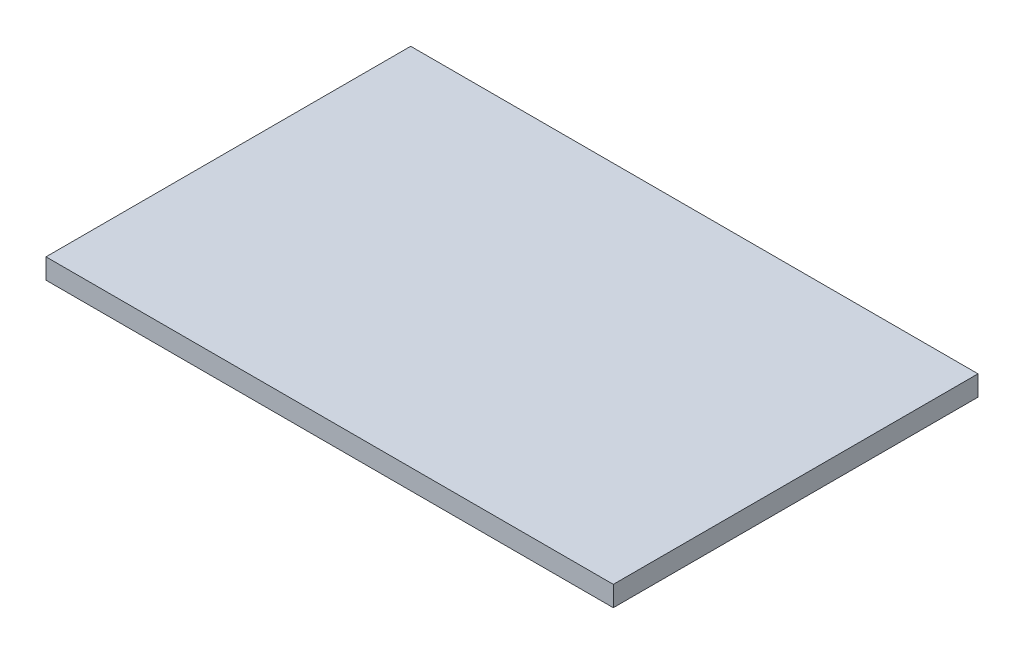
ISO-10303-21;
HEADER;
FILE_DESCRIPTION(('STEP AP214'),'2;1');
FILE_NAME('part.step','',(''),(''),'','','');
FILE_SCHEMA(('AUTOMOTIVE_DESIGN { 1 0 10303 214 1 1 1 1 }'));
ENDSEC;
DATA;
#1=APPLICATION_CONTEXT('core data for automotive mechanical design processes');
#2=APPLICATION_PROTOCOL_DEFINITION('international standard','automotive_design',2000,#1);
#3=PRODUCT_CONTEXT('',#1,'mechanical');
#4=PRODUCT('Part','Part','',(#3));
#5=PRODUCT_RELATED_PRODUCT_CATEGORY('part','',(#4));
#6=PRODUCT_DEFINITION_FORMATION('','',#4);
#7=PRODUCT_DEFINITION_CONTEXT('part definition',#1,'design');
#8=PRODUCT_DEFINITION('design','',#6,#7);
#9=PRODUCT_DEFINITION_SHAPE('','',#8);
#10=(LENGTH_UNIT() NAMED_UNIT(*) SI_UNIT(.MILLI.,.METRE.));
#11=(NAMED_UNIT(*) PLANE_ANGLE_UNIT() SI_UNIT($,.RADIAN.));
#12=(NAMED_UNIT(*) SI_UNIT($,.STERADIAN.) SOLID_ANGLE_UNIT());
#13=UNCERTAINTY_MEASURE_WITH_UNIT(LENGTH_MEASURE(1.E-05),#10,'distance_accuracy_value','');
#14=(GEOMETRIC_REPRESENTATION_CONTEXT(3) GLOBAL_UNCERTAINTY_ASSIGNED_CONTEXT((#13)) GLOBAL_UNIT_ASSIGNED_CONTEXT((#10,
#11,#12)) REPRESENTATION_CONTEXT('',''));
#15=CARTESIAN_POINT('',(0.,0.,0.));
#16=DIRECTION('',(0.,0.,1.));
#17=DIRECTION('',(1.,0.,0.));
#18=AXIS2_PLACEMENT_3D('',#15,#16,#17);
#19=CARTESIAN_POINT('',(0.,0.25,0.));
#20=DIRECTION('',(1.,0.,0.));
#21=DIRECTION('',(0.,0.,-1.));
#22=AXIS2_PLACEMENT_3D('',#19,#20,#21);
#23=PLANE('',#22);
#24=DIRECTION('',(0.,0.,1.));
#25=VECTOR('',#24,1.);
#26=CARTESIAN_POINT('',(0.,0.,0.));
#27=LINE('',#26,#25);
#28=CARTESIAN_POINT('',(0.,0.,-4.5));
#29=VERTEX_POINT('',#28);
#30=CARTESIAN_POINT('',(0.,0.,0.));
#31=VERTEX_POINT('',#30);
#32=EDGE_CURVE('E96',#29,#31,#27,.T.);
#33=ORIENTED_EDGE('',*,*,#32,.T.);
#34=DIRECTION('',(0.,-1.,0.));
#35=VECTOR('',#34,1.);
#36=CARTESIAN_POINT('',(0.,0.25,0.));
#37=LINE('',#36,#35);
#38=CARTESIAN_POINT('',(0.,0.25,0.));
#39=VERTEX_POINT('',#38);
#40=EDGE_CURVE('E11',#39,#31,#37,.T.);
#41=ORIENTED_EDGE('',*,*,#40,.F.);
#42=DIRECTION('',(0.,0.,1.));
#43=VECTOR('',#42,1.);
#44=CARTESIAN_POINT('',(0.,0.25,0.));
#45=LINE('',#44,#43);
#46=CARTESIAN_POINT('',(0.,0.25,-4.5));
#47=VERTEX_POINT('',#46);
#48=EDGE_CURVE('E84',#47,#39,#45,.T.);
#49=ORIENTED_EDGE('',*,*,#48,.F.);
#50=DIRECTION('',(0.,-1.,0.));
#51=VECTOR('',#50,1.);
#52=CARTESIAN_POINT('',(0.,0.25,-4.5));
#53=LINE('',#52,#51);
#54=EDGE_CURVE('E92',#47,#29,#53,.T.);
#55=ORIENTED_EDGE('',*,*,#54,.T.);
#56=EDGE_LOOP('',(#33,#41,#49,#55));
#57=FACE_BOUND('',#56,.T.);
#58=ADVANCED_FACE('F33',(#57),#23,.F.);
#59=CARTESIAN_POINT('',(0.,0.25,0.));
#60=DIRECTION('',(0.,0.,-1.));
#61=DIRECTION('',(-1.,0.,0.));
#62=AXIS2_PLACEMENT_3D('',#59,#60,#61);
#63=PLANE('',#62);
#64=DIRECTION('',(1.,0.,0.));
#65=VECTOR('',#64,1.);
#66=CARTESIAN_POINT('',(0.,0.,0.));
#67=LINE('',#66,#65);
#68=CARTESIAN_POINT('',(7.00000000000001,0.,0.));
#69=VERTEX_POINT('',#68);
#70=EDGE_CURVE('E88',#31,#69,#67,.T.);
#71=ORIENTED_EDGE('',*,*,#70,.T.);
#72=DIRECTION('',(0.,-1.,0.));
#73=VECTOR('',#72,1.);
#74=CARTESIAN_POINT('',(7.00000000000001,0.25,0.));
#75=LINE('',#74,#73);
#76=CARTESIAN_POINT('',(7.00000000000001,0.25,0.));
#77=VERTEX_POINT('',#76);
#78=EDGE_CURVE('E41',#77,#69,#75,.T.);
#79=ORIENTED_EDGE('',*,*,#78,.F.);
#80=DIRECTION('',(1.,0.,0.));
#81=VECTOR('',#80,1.);
#82=CARTESIAN_POINT('',(0.,0.25,0.));
#83=LINE('',#82,#81);
#84=EDGE_CURVE('E79',#39,#77,#83,.T.);
#85=ORIENTED_EDGE('',*,*,#84,.F.);
#86=ORIENTED_EDGE('',*,*,#40,.T.);
#87=EDGE_LOOP('',(#71,#79,#85,#86));
#88=FACE_BOUND('',#87,.T.);
#89=ADVANCED_FACE('F87',(#88),#63,.F.);
#90=CARTESIAN_POINT('',(7.00000000000001,0.25,0.));
#91=DIRECTION('',(-1.,0.,0.));
#92=DIRECTION('',(0.,0.,1.));
#93=AXIS2_PLACEMENT_3D('',#90,#91,#92);
#94=PLANE('',#93);
#95=DIRECTION('',(0.,0.,-1.));
#96=VECTOR('',#95,1.);
#97=CARTESIAN_POINT('',(7.00000000000001,0.,0.));
#98=LINE('',#97,#96);
#99=CARTESIAN_POINT('',(7.00000000000001,0.,-4.5));
#100=VERTEX_POINT('',#99);
#101=EDGE_CURVE('E66',#69,#100,#98,.T.);
#102=ORIENTED_EDGE('',*,*,#101,.T.);
#103=DIRECTION('',(0.,-1.,0.));
#104=VECTOR('',#103,1.);
#105=CARTESIAN_POINT('',(7.00000000000001,0.25,-4.5));
#106=LINE('',#105,#104);
#107=CARTESIAN_POINT('',(7.00000000000001,0.25,-4.5));
#108=VERTEX_POINT('',#107);
#109=EDGE_CURVE('E89',#108,#100,#106,.T.);
#110=ORIENTED_EDGE('',*,*,#109,.F.);
#111=DIRECTION('',(0.,0.,-1.));
#112=VECTOR('',#111,1.);
#113=CARTESIAN_POINT('',(7.00000000000001,0.25,0.));
#114=LINE('',#113,#112);
#115=EDGE_CURVE('E82',#77,#108,#114,.T.);
#116=ORIENTED_EDGE('',*,*,#115,.F.);
#117=ORIENTED_EDGE('',*,*,#78,.T.);
#118=EDGE_LOOP('',(#102,#110,#116,#117));
#119=FACE_BOUND('',#118,.T.);
#120=ADVANCED_FACE('F90',(#119),#94,.F.);
#121=CARTESIAN_POINT('',(0.,0.25,-4.5));
#122=DIRECTION('',(0.,0.,1.));
#123=DIRECTION('',(1.,0.,0.));
#124=AXIS2_PLACEMENT_3D('',#121,#122,#123);
#125=PLANE('',#124);
#126=DIRECTION('',(-1.,0.,0.));
#127=VECTOR('',#126,1.);
#128=CARTESIAN_POINT('',(0.,0.,-4.5));
#129=LINE('',#128,#127);
#130=EDGE_CURVE('E72',#100,#29,#129,.T.);
#131=ORIENTED_EDGE('',*,*,#130,.T.);
#132=ORIENTED_EDGE('',*,*,#54,.F.);
#133=DIRECTION('',(-1.,0.,0.));
#134=VECTOR('',#133,1.);
#135=CARTESIAN_POINT('',(0.,0.25,-4.5));
#136=LINE('',#135,#134);
#137=EDGE_CURVE('E49',#108,#47,#136,.T.);
#138=ORIENTED_EDGE('',*,*,#137,.F.);
#139=ORIENTED_EDGE('',*,*,#109,.T.);
#140=EDGE_LOOP('',(#131,#132,#138,#139));
#141=FACE_BOUND('',#140,.T.);
#142=ADVANCED_FACE('F103',(#141),#125,.F.);
#143=CARTESIAN_POINT('',(0.,0.25,-4.5));
#144=DIRECTION('',(0.,-1.,0.));
#145=DIRECTION('',(0.,0.,-1.));
#146=AXIS2_PLACEMENT_3D('',#143,#144,#145);
#147=PLANE('',#146);
#148=ORIENTED_EDGE('',*,*,#48,.T.);
#149=ORIENTED_EDGE('',*,*,#84,.T.);
#150=ORIENTED_EDGE('',*,*,#115,.T.);
#151=ORIENTED_EDGE('',*,*,#137,.T.);
#152=EDGE_LOOP('',(#148,#149,#150,#151));
#153=FACE_BOUND('',#152,.T.);
#154=ADVANCED_FACE('F80',(#153),#147,.F.);
#155=CARTESIAN_POINT('',(0.,0.,-4.5));
#156=DIRECTION('',(0.,-1.,0.));
#157=DIRECTION('',(0.,0.,-1.));
#158=AXIS2_PLACEMENT_3D('',#155,#156,#157);
#159=PLANE('',#158);
#160=ORIENTED_EDGE('',*,*,#32,.F.);
#161=ORIENTED_EDGE('',*,*,#130,.F.);
#162=ORIENTED_EDGE('',*,*,#101,.F.);
#163=ORIENTED_EDGE('',*,*,#70,.F.);
#164=EDGE_LOOP('',(#160,#161,#162,#163));
#165=FACE_BOUND('',#164,.T.);
#166=ADVANCED_FACE('F106',(#165),#159,.T.);
#167=CLOSED_SHELL('',(#58,#89,#120,#142,#154,#166));
#168=MANIFOLD_SOLID_BREP('B2',#167);
#169=ADVANCED_BREP_SHAPE_REPRESENTATION('',(#18,#168),#14);
#170=SHAPE_DEFINITION_REPRESENTATION(#9,#169);
ENDSEC;
END-ISO-10303-21;
